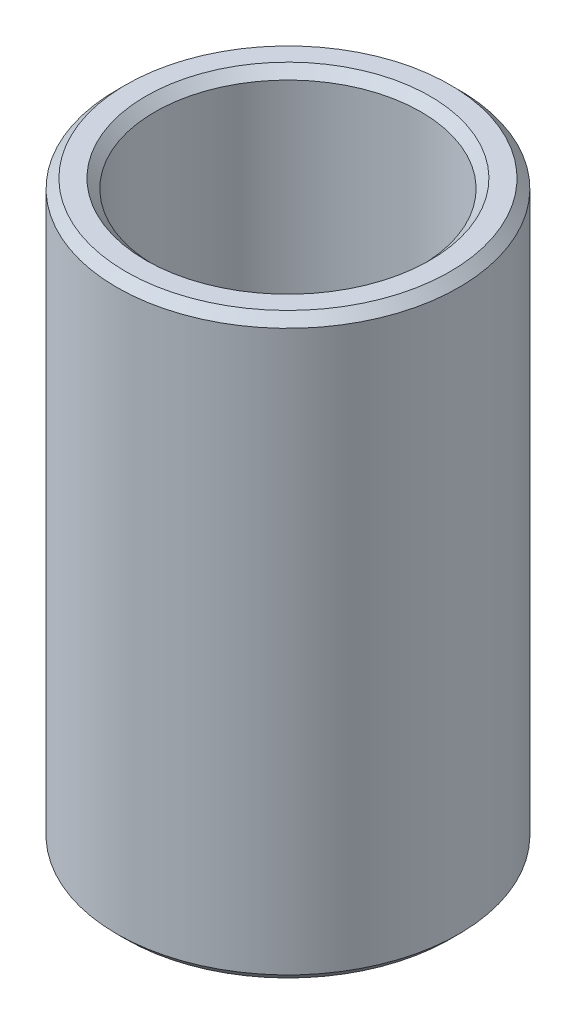
ISO-10303-21;
HEADER;
FILE_DESCRIPTION(('STEP AP214'),'2;1');
FILE_NAME('part.step','',(''),(''),'','','');
FILE_SCHEMA(('AUTOMOTIVE_DESIGN { 1 0 10303 214 1 1 1 1 }'));
ENDSEC;
DATA;
#1=APPLICATION_CONTEXT('core data for automotive mechanical design processes');
#2=APPLICATION_PROTOCOL_DEFINITION('international standard','automotive_design',2000,#1);
#3=PRODUCT_CONTEXT('',#1,'mechanical');
#4=PRODUCT('Part','Part','',(#3));
#5=PRODUCT_RELATED_PRODUCT_CATEGORY('part','',(#4));
#6=PRODUCT_DEFINITION_FORMATION('','',#4);
#7=PRODUCT_DEFINITION_CONTEXT('part definition',#1,'design');
#8=PRODUCT_DEFINITION('design','',#6,#7);
#9=PRODUCT_DEFINITION_SHAPE('','',#8);
#10=(LENGTH_UNIT() NAMED_UNIT(*) SI_UNIT(.MILLI.,.METRE.));
#11=(NAMED_UNIT(*) PLANE_ANGLE_UNIT() SI_UNIT($,.RADIAN.));
#12=(NAMED_UNIT(*) SI_UNIT($,.STERADIAN.) SOLID_ANGLE_UNIT());
#13=UNCERTAINTY_MEASURE_WITH_UNIT(LENGTH_MEASURE(1.E-05),#10,'distance_accuracy_value','');
#14=(GEOMETRIC_REPRESENTATION_CONTEXT(3) GLOBAL_UNCERTAINTY_ASSIGNED_CONTEXT((#13)) GLOBAL_UNIT_ASSIGNED_CONTEXT((#10,
#11,#12)) REPRESENTATION_CONTEXT('',''));
#15=CARTESIAN_POINT('',(0.,0.,0.));
#16=DIRECTION('',(0.,0.,1.));
#17=DIRECTION('',(1.,0.,0.));
#18=AXIS2_PLACEMENT_3D('',#15,#16,#17);
#19=CARTESIAN_POINT('',(0.,185.86655824281,0.));
#20=DIRECTION('',(0.,-1.,0.));
#21=DIRECTION('',(0.,0.,-1.));
#22=AXIS2_PLACEMENT_3D('',#19,#20,#21);
#23=CYLINDRICAL_SURFACE('',#22,55.);
#24=CARTESIAN_POINT('',(0.,2.91759046104426,0.));
#25=DIRECTION('',(0.,1.,0.));
#26=DIRECTION('',(0.,0.,1.));
#27=AXIS2_PLACEMENT_3D('',#24,#25,#26);
#28=CIRCLE('',#27,55.);
#29=CARTESIAN_POINT('',(0.,2.91759046104426,55.));
#30=VERTEX_POINT('',#29);
#31=EDGE_CURVE('E10',#30,#30,#28,.T.);
#32=ORIENTED_EDGE('',*,*,#31,.T.);
#33=EDGE_LOOP('',(#32));
#34=FACE_BOUND('',#33,.T.);
#35=CARTESIAN_POINT('',(0.,182.948967781766,0.));
#36=DIRECTION('',(0.,1.,0.));
#37=DIRECTION('',(0.,0.,1.));
#38=AXIS2_PLACEMENT_3D('',#35,#36,#37);
#39=CIRCLE('',#38,55.);
#40=CARTESIAN_POINT('',(0.,182.948967781766,55.));
#41=VERTEX_POINT('',#40);
#42=EDGE_CURVE('E50',#41,#41,#39,.F.);
#43=ORIENTED_EDGE('',*,*,#42,.T.);
#44=EDGE_LOOP('',(#43));
#45=FACE_BOUND('',#44,.T.);
#46=ADVANCED_FACE('F39',(#34,#45),#23,.T.);
#47=CARTESIAN_POINT('',(0.,185.86655824281,0.));
#48=DIRECTION('',(0.,1.,0.));
#49=DIRECTION('',(0.,0.,1.));
#50=AXIS2_PLACEMENT_3D('',#47,#48,#49);
#51=PLANE('',#50);
#52=CARTESIAN_POINT('',(0.,185.86655824281,0.));
#53=DIRECTION('',(0.,1.,0.));
#54=DIRECTION('',(0.,0.,1.));
#55=AXIS2_PLACEMENT_3D('',#52,#53,#54);
#56=CIRCLE('',#55,45.6975192132792);
#57=CARTESIAN_POINT('',(0.,185.86655824281,45.6975192132792));
#58=VERTEX_POINT('',#57);
#59=EDGE_CURVE('E58',#58,#58,#56,.F.);
#60=ORIENTED_EDGE('',*,*,#59,.T.);
#61=EDGE_LOOP('',(#60));
#62=FACE_BOUND('',#61,.T.);
#63=CARTESIAN_POINT('',(0.,185.86655824281,0.));
#64=DIRECTION('',(0.,1.,0.));
#65=DIRECTION('',(0.,0.,1.));
#66=AXIS2_PLACEMENT_3D('',#63,#64,#65);
#67=CIRCLE('',#66,52.0824095389557);
#68=CARTESIAN_POINT('',(0.,185.86655824281,52.0824095389557));
#69=VERTEX_POINT('',#68);
#70=EDGE_CURVE('E61',#69,#69,#67,.T.);
#71=ORIENTED_EDGE('',*,*,#70,.T.);
#72=EDGE_LOOP('',(#71));
#73=FACE_BOUND('',#72,.T.);
#74=ADVANCED_FACE('F88',(#62,#73),#51,.T.);
#75=CARTESIAN_POINT('',(0.,0.,0.));
#76=DIRECTION('',(0.,1.,0.));
#77=DIRECTION('',(0.,0.,1.));
#78=AXIS2_PLACEMENT_3D('',#75,#76,#77);
#79=PLANE('',#78);
#80=CARTESIAN_POINT('',(0.,0.,0.));
#81=DIRECTION('',(0.,1.,0.));
#82=DIRECTION('',(0.,0.,1.));
#83=AXIS2_PLACEMENT_3D('',#80,#81,#82);
#84=CIRCLE('',#83,45.6975192132792);
#85=CARTESIAN_POINT('',(0.,0.,45.6975192132792));
#86=VERTEX_POINT('',#85);
#87=EDGE_CURVE('E51',#86,#86,#84,.T.);
#88=ORIENTED_EDGE('',*,*,#87,.T.);
#89=EDGE_LOOP('',(#88));
#90=FACE_BOUND('',#89,.T.);
#91=CARTESIAN_POINT('',(0.,0.,0.));
#92=DIRECTION('',(0.,1.,0.));
#93=DIRECTION('',(0.,0.,1.));
#94=AXIS2_PLACEMENT_3D('',#91,#92,#93);
#95=CIRCLE('',#94,52.0824095389557);
#96=CARTESIAN_POINT('',(0.,0.,52.0824095389557));
#97=VERTEX_POINT('',#96);
#98=EDGE_CURVE('E54',#97,#97,#95,.F.);
#99=ORIENTED_EDGE('',*,*,#98,.T.);
#100=EDGE_LOOP('',(#99));
#101=FACE_BOUND('',#100,.T.);
#102=ADVANCED_FACE('F83',(#90,#101),#79,.F.);
#103=CARTESIAN_POINT('',(0.,185.86655824281,0.));
#104=DIRECTION('',(0.,-1.,0.));
#105=DIRECTION('',(0.,0.,-1.));
#106=AXIS2_PLACEMENT_3D('',#103,#104,#105);
#107=CYLINDRICAL_SURFACE('',#106,42.7799287522349);
#108=CARTESIAN_POINT('',(0.,182.948967781766,0.));
#109=DIRECTION('',(0.,1.,0.));
#110=DIRECTION('',(0.,0.,1.));
#111=AXIS2_PLACEMENT_3D('',#108,#109,#110);
#112=CIRCLE('',#111,42.7799287522349);
#113=CARTESIAN_POINT('',(0.,182.948967781766,42.7799287522349));
#114=VERTEX_POINT('',#113);
#115=EDGE_CURVE('E67',#114,#114,#112,.T.);
#116=ORIENTED_EDGE('',*,*,#115,.T.);
#117=EDGE_LOOP('',(#116));
#118=FACE_BOUND('',#117,.T.);
#119=CARTESIAN_POINT('',(0.,2.91759046104423,0.));
#120=DIRECTION('',(0.,1.,0.));
#121=DIRECTION('',(0.,0.,1.));
#122=AXIS2_PLACEMENT_3D('',#119,#120,#121);
#123=CIRCLE('',#122,42.7799287522349);
#124=CARTESIAN_POINT('',(0.,2.91759046104423,42.7799287522349));
#125=VERTEX_POINT('',#124);
#126=EDGE_CURVE('E69',#125,#125,#123,.F.);
#127=ORIENTED_EDGE('',*,*,#126,.T.);
#128=EDGE_LOOP('',(#127));
#129=FACE_BOUND('',#128,.T.);
#130=ADVANCED_FACE('F71',(#118,#129),#107,.F.);
#131=CARTESIAN_POINT('',(0.,182.948967781766,0.));
#132=DIRECTION('',(0.,1.,0.));
#133=DIRECTION('',(0.,0.,1.));
#134=AXIS2_PLACEMENT_3D('',#131,#132,#133);
#135=CONICAL_SURFACE('',#134,42.7799287522349,0.785398163397446);
#136=CARTESIAN_POINT('',(0.,185.86655824281,45.6975192132792));
#137=CARTESIAN_POINT('',(0.,185.836166675508,45.6671276459766));
#138=CARTESIAN_POINT('',(0.,185.805775108205,45.6367360786741));
#139=CARTESIAN_POINT('',(0.,185.7449919736,45.575952944069));
#140=CARTESIAN_POINT('',(0.,185.714600406298,45.5455613767665));
#141=CARTESIAN_POINT('',(0.,185.653817271693,45.4847782421614));
#142=CARTESIAN_POINT('',(0.,185.62342570439,45.4543866748588));
#143=CARTESIAN_POINT('',(0.,185.562642569785,45.3936035402537));
#144=CARTESIAN_POINT('',(0.,185.532251002482,45.3632119729512));
#145=CARTESIAN_POINT('',(0.,185.471467867877,45.3024288383461));
#146=CARTESIAN_POINT('',(0.,185.441076300575,45.2720372710436));
#147=CARTESIAN_POINT('',(0.,185.38029316597,45.2112541364385));
#148=CARTESIAN_POINT('',(0.,185.349901598667,45.1808625691359));
#149=CARTESIAN_POINT('',(0.,185.289118464062,45.1200794345308));
#150=CARTESIAN_POINT('',(0.,185.25872689676,45.0896878672283));
#151=CARTESIAN_POINT('',(0.,185.197943762155,45.0289047326232));
#152=CARTESIAN_POINT('',(0.,185.167552194852,44.9985131653207));
#153=CARTESIAN_POINT('',(0.,185.106769060247,44.9377300307156));
#154=CARTESIAN_POINT('',(0.,185.076377492944,44.907338463413));
#155=CARTESIAN_POINT('',(0.,185.015594358339,44.8465553288079));
#156=CARTESIAN_POINT('',(0.,184.985202791037,44.8161637615054));
#157=CARTESIAN_POINT('',(0.,184.924419656432,44.7553806269003));
#158=CARTESIAN_POINT('',(0.,184.894028089129,44.7249890595978));
#159=CARTESIAN_POINT('',(0.,184.833244954524,44.6642059249927));
#160=CARTESIAN_POINT('',(0.,184.802853387221,44.6338143576901));
#161=CARTESIAN_POINT('',(0.,184.742070252616,44.573031223085));
#162=CARTESIAN_POINT('',(0.,184.711678685314,44.5426396557825));
#163=CARTESIAN_POINT('',(0.,184.650895550709,44.4818565211774));
#164=CARTESIAN_POINT('',(0.,184.620503983406,44.4514649538748));
#165=CARTESIAN_POINT('',(0.,184.559720848801,44.3906818192698));
#166=CARTESIAN_POINT('',(0.,184.529329281499,44.3602902519672));
#167=CARTESIAN_POINT('',(0.,184.468546146893,44.2995071173621));
#168=CARTESIAN_POINT('',(0.,184.438154579591,44.2691155500596));
#169=CARTESIAN_POINT('',(0.,184.377371444986,44.2083324154545));
#170=CARTESIAN_POINT('',(0.,184.346979877683,44.1779408481519));
#171=CARTESIAN_POINT('',(0.,184.286196743078,44.1171577135469));
#172=CARTESIAN_POINT('',(0.,184.255805175776,44.0867661462443));
#173=CARTESIAN_POINT('',(0.,184.195022041171,44.0259830116392));
#174=CARTESIAN_POINT('',(0.,184.164630473868,43.9955914443367));
#175=CARTESIAN_POINT('',(0.,184.103847339263,43.9348083097316));
#176=CARTESIAN_POINT('',(0.,184.07345577196,43.904416742429));
#177=CARTESIAN_POINT('',(0.,184.012672637355,43.843633607824));
#178=CARTESIAN_POINT('',(0.,183.982281070053,43.8132420405214));
#179=CARTESIAN_POINT('',(0.,183.921497935448,43.7524589059163));
#180=CARTESIAN_POINT('',(0.,183.891106368145,43.7220673386138));
#181=CARTESIAN_POINT('',(0.,183.83032323354,43.6612842040087));
#182=CARTESIAN_POINT('',(0.,183.799931666237,43.6308926367062));
#183=CARTESIAN_POINT('',(0.,183.739148531632,43.5701095021011));
#184=CARTESIAN_POINT('',(0.,183.70875696433,43.5397179347985));
#185=CARTESIAN_POINT('',(0.,183.647973829725,43.4789348001934));
#186=CARTESIAN_POINT('',(0.,183.617582262422,43.4485432328909));
#187=CARTESIAN_POINT('',(0.,183.556799127817,43.3877600982858));
#188=CARTESIAN_POINT('',(0.,183.526407560515,43.3573685309833));
#189=CARTESIAN_POINT('',(0.,183.465624425909,43.2965853963782));
#190=CARTESIAN_POINT('',(0.,183.435232858607,43.2661938290756));
#191=CARTESIAN_POINT('',(0.,183.374449724002,43.2054106944705));
#192=CARTESIAN_POINT('',(0.,183.344058156699,43.175019127168));
#193=CARTESIAN_POINT('',(0.,183.283275022094,43.1142359925629));
#194=CARTESIAN_POINT('',(0.,183.252883454792,43.0838444252604));
#195=CARTESIAN_POINT('',(0.,183.192100320187,43.0230612906553));
#196=CARTESIAN_POINT('',(0.,183.161708752884,42.9926697233527));
#197=CARTESIAN_POINT('',(0.,183.100925618279,42.9318865887476));
#198=CARTESIAN_POINT('',(0.,183.070534050976,42.9014950214451));
#199=CARTESIAN_POINT('',(0.,183.009750916371,42.84071188684));
#200=CARTESIAN_POINT('',(0.,182.979359349069,42.8103203195375));
#201=CARTESIAN_POINT('',(0.,182.948967781766,42.7799287522349));
#202=B_SPLINE_CURVE_WITH_KNOTS('',3,(#136,#137,#138,#139,#140,#141,#142,#143,#144,#145,#146,
#147,#148,#149,#150,#151,#152,#153,#154,#155,#156,#157,#158,#159,#160,#161,#162,#163,#164,#165,
#166,#167,#168,#169,#170,#171,#172,#173,#174,#175,#176,#177,#178,#179,#180,#181,#182,#183,#184,
#185,#186,#187,#188,#189,#190,#191,#192,#193,#194,#195,#196,#197,#198,#199,#200,#201),
.UNSPECIFIED.,.F.,.F.,(4,2,2,2,2,2,2,2,2,2,2,2,2,2,2,2,2,2,2,2,2,2,2,2,2,2,2,2,2,2,2,2,4),(0.,
0.128940499983088,0.25788099996619,0.386821499949297,0.515761999932385,0.644702499915487,
0.773642999898594,0.902583499881682,1.03152399986479,1.16046449984789,1.28940499983098,
1.41834549981409,1.54728599979719,1.67622649978028,1.80516699976338,1.93410749974649,
2.06304799972959,2.19198849971268,2.32092899969578,2.44986949967889,2.57880999966198,
2.70775049964508,2.83669099962819,2.96563149961128,3.09457199959438,3.22351249957748,
3.35245299956057,3.48139349954368,3.61033399952678,3.73927449950987,3.86821499949298,
3.99715549947608,4.12609599945917),.UNSPECIFIED.);
#203=EDGE_CURVE('BSEAM77',#58,#114,#202,.T.);
#204=ORIENTED_EDGE('',*,*,#59,.F.);
#205=ORIENTED_EDGE('',*,*,#115,.F.);
#206=ORIENTED_EDGE('',*,*,#203,.T.);
#207=ORIENTED_EDGE('',*,*,#203,.F.);
#208=EDGE_LOOP('',(#204,#206,#205,#207));
#209=FACE_BOUND('',#208,.T.);
#210=ADVANCED_FACE('F77',(#209),#135,.F.);
#211=CARTESIAN_POINT('',(0.,0.,0.));
#212=DIRECTION('',(0.,-1.,0.));
#213=DIRECTION('',(0.,0.,-1.));
#214=AXIS2_PLACEMENT_3D('',#211,#212,#213);
#215=CONICAL_SURFACE('',#214,45.6975192132792,0.785398163397451);
#216=ORIENTED_EDGE('',*,*,#126,.F.);
#217=EDGE_LOOP('',(#216));
#218=FACE_BOUND('',#217,.T.);
#219=ORIENTED_EDGE('',*,*,#87,.F.);
#220=EDGE_LOOP('',(#219));
#221=FACE_BOUND('',#220,.T.);
#222=ADVANCED_FACE('F73',(#218,#221),#215,.F.);
#223=CARTESIAN_POINT('',(0.,2.91759046104426,0.));
#224=DIRECTION('',(0.,1.,0.));
#225=DIRECTION('',(0.,0.,1.));
#226=AXIS2_PLACEMENT_3D('',#223,#224,#225);
#227=CONICAL_SURFACE('',#226,55.,0.785398163397452);
#228=ORIENTED_EDGE('',*,*,#98,.F.);
#229=EDGE_LOOP('',(#228));
#230=FACE_BOUND('',#229,.T.);
#231=ORIENTED_EDGE('',*,*,#31,.F.);
#232=EDGE_LOOP('',(#231));
#233=FACE_BOUND('',#232,.T.);
#234=ADVANCED_FACE('F76',(#230,#233),#227,.T.);
#235=CARTESIAN_POINT('',(0.,185.86655824281,0.));
#236=DIRECTION('',(0.,-1.,0.));
#237=DIRECTION('',(0.,0.,-1.));
#238=AXIS2_PLACEMENT_3D('',#235,#236,#237);
#239=CONICAL_SURFACE('',#238,52.0824095389557,0.785398163397445);
#240=ORIENTED_EDGE('',*,*,#42,.F.);
#241=EDGE_LOOP('',(#240));
#242=FACE_BOUND('',#241,.T.);
#243=ORIENTED_EDGE('',*,*,#70,.F.);
#244=EDGE_LOOP('',(#243));
#245=FACE_BOUND('',#244,.T.);
#246=ADVANCED_FACE('F45',(#242,#245),#239,.T.);
#247=CLOSED_SHELL('',(#46,#74,#102,#130,#210,#222,#234,#246));
#248=MANIFOLD_SOLID_BREP('B2',#247);
#249=ADVANCED_BREP_SHAPE_REPRESENTATION('',(#18,#248),#14);
#250=SHAPE_DEFINITION_REPRESENTATION(#9,#249);
ENDSEC;
END-ISO-10303-21;
